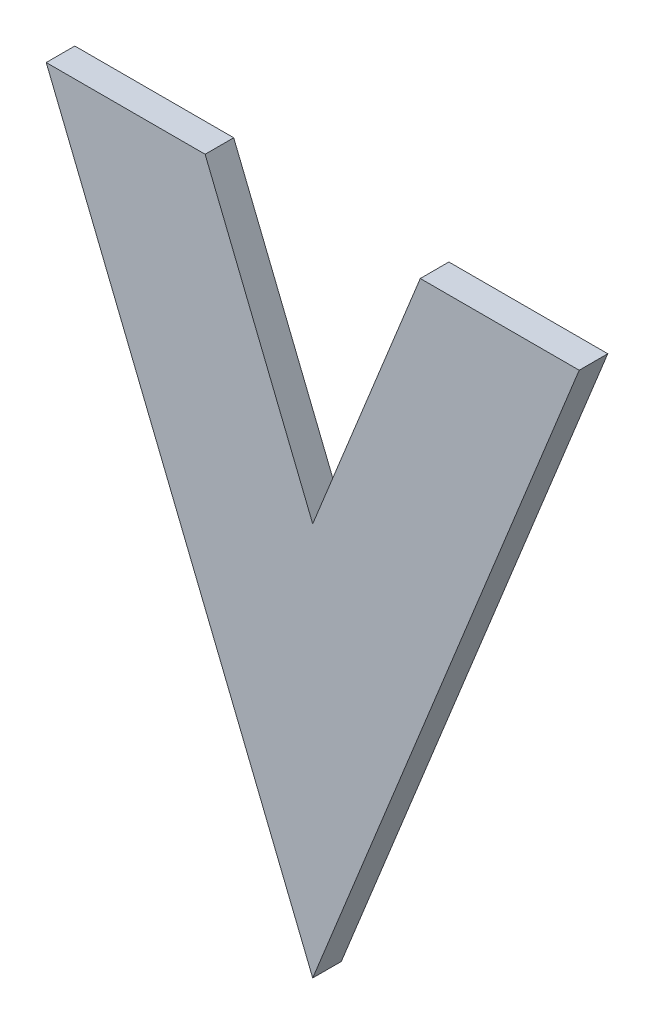
ISO-10303-21;
HEADER;
FILE_DESCRIPTION(('STEP AP214'),'2;1');
FILE_NAME('part.step','',(''),(''),'','','');
FILE_SCHEMA(('AUTOMOTIVE_DESIGN { 1 0 10303 214 1 1 1 1 }'));
ENDSEC;
DATA;
#1=APPLICATION_CONTEXT('core data for automotive mechanical design processes');
#2=APPLICATION_PROTOCOL_DEFINITION('international standard','automotive_design',2000,#1);
#3=PRODUCT_CONTEXT('',#1,'mechanical');
#4=PRODUCT('Part','Part','',(#3));
#5=PRODUCT_RELATED_PRODUCT_CATEGORY('part','',(#4));
#6=PRODUCT_DEFINITION_FORMATION('','',#4);
#7=PRODUCT_DEFINITION_CONTEXT('part definition',#1,'design');
#8=PRODUCT_DEFINITION('design','',#6,#7);
#9=PRODUCT_DEFINITION_SHAPE('','',#8);
#10=(LENGTH_UNIT() NAMED_UNIT(*) SI_UNIT(.MILLI.,.METRE.));
#11=(NAMED_UNIT(*) PLANE_ANGLE_UNIT() SI_UNIT($,.RADIAN.));
#12=(NAMED_UNIT(*) SI_UNIT($,.STERADIAN.) SOLID_ANGLE_UNIT());
#13=UNCERTAINTY_MEASURE_WITH_UNIT(LENGTH_MEASURE(1.E-05),#10,'distance_accuracy_value','');
#14=(GEOMETRIC_REPRESENTATION_CONTEXT(3) GLOBAL_UNCERTAINTY_ASSIGNED_CONTEXT((#13)) GLOBAL_UNIT_ASSIGNED_CONTEXT((#10,
#11,#12)) REPRESENTATION_CONTEXT('',''));
#15=CARTESIAN_POINT('',(0.,0.,0.));
#16=DIRECTION('',(0.,0.,1.));
#17=DIRECTION('',(1.,0.,0.));
#18=AXIS2_PLACEMENT_3D('',#15,#16,#17);
#19=CARTESIAN_POINT('',(0.0956398811616661,-0.536906195260859,0.));
#20=DIRECTION('',(0.927183854566715,-0.37460659341609,0.));
#21=DIRECTION('',(0.37460659341609,0.927183854566715,0.));
#22=AXIS2_PLACEMENT_3D('',#19,#20,#21);
#23=PLANE('',#22);
#24=DIRECTION('',(0.37460659341609,0.927183854566715,0.));
#25=VECTOR('',#24,1.);
#26=CARTESIAN_POINT('',(0.0956398811616661,-0.536906195260859,0.));
#27=LINE('',#26,#25);
#28=CARTESIAN_POINT('',(0.0956398811616661,-0.536906195260859,0.));
#29=VERTEX_POINT('',#28);
#30=CARTESIAN_POINT('',(0.123607816936886,-0.467683125106459,0.));
#31=VERTEX_POINT('',#30);
#32=EDGE_CURVE('E11',#29,#31,#27,.T.);
#33=ORIENTED_EDGE('',*,*,#32,.T.);
#34=DIRECTION('',(0.,0.,1.));
#35=VECTOR('',#34,1.);
#36=CARTESIAN_POINT('',(0.123607816936886,-0.467683125106459,0.));
#37=LINE('',#36,#35);
#38=CARTESIAN_POINT('',(0.123607816936886,-0.467683125106459,0.003));
#39=VERTEX_POINT('',#38);
#40=EDGE_CURVE('E24',#31,#39,#37,.T.);
#41=ORIENTED_EDGE('',*,*,#40,.T.);
#42=DIRECTION('',(0.37460659341609,0.927183854566715,0.));
#43=VECTOR('',#42,1.);
#44=CARTESIAN_POINT('',(0.0956398811616661,-0.536906195260859,0.003));
#45=LINE('',#44,#43);
#46=CARTESIAN_POINT('',(0.0956398811616661,-0.536906195260859,0.003));
#47=VERTEX_POINT('',#46);
#48=EDGE_CURVE('E88',#47,#39,#45,.T.);
#49=ORIENTED_EDGE('',*,*,#48,.F.);
#50=DIRECTION('',(0.,0.,1.));
#51=VECTOR('',#50,1.);
#52=CARTESIAN_POINT('',(0.0956398811616661,-0.536906195260859,0.));
#53=LINE('',#52,#51);
#54=EDGE_CURVE('E116',#29,#47,#53,.T.);
#55=ORIENTED_EDGE('',*,*,#54,.F.);
#56=EDGE_LOOP('',(#33,#41,#49,#55));
#57=FACE_BOUND('',#56,.T.);
#58=ADVANCED_FACE('F17',(#57),#23,.T.);
#59=CARTESIAN_POINT('',(0.0676719453864461,-0.467683125106459,0.));
#60=DIRECTION('',(-0.927183854566715,-0.374606593416091,0.));
#61=DIRECTION('',(0.374606593416091,-0.927183854566715,0.));
#62=AXIS2_PLACEMENT_3D('',#59,#60,#61);
#63=PLANE('',#62);
#64=DIRECTION('',(0.374606593416091,-0.927183854566715,0.));
#65=VECTOR('',#64,1.);
#66=CARTESIAN_POINT('',(0.0676719453864461,-0.467683125106459,0.));
#67=LINE('',#66,#65);
#68=CARTESIAN_POINT('',(0.0676719453864461,-0.467683125106459,0.));
#69=VERTEX_POINT('',#68);
#70=EDGE_CURVE('E113',#69,#29,#67,.T.);
#71=ORIENTED_EDGE('',*,*,#70,.T.);
#72=ORIENTED_EDGE('',*,*,#54,.T.);
#73=DIRECTION('',(0.374606593416091,-0.927183854566715,0.));
#74=VECTOR('',#73,1.);
#75=CARTESIAN_POINT('',(0.0676719453864461,-0.467683125106459,0.003));
#76=LINE('',#75,#74);
#77=CARTESIAN_POINT('',(0.0676719453864461,-0.467683125106459,0.003));
#78=VERTEX_POINT('',#77);
#79=EDGE_CURVE('E111',#78,#47,#76,.T.);
#80=ORIENTED_EDGE('',*,*,#79,.F.);
#81=DIRECTION('',(0.,0.,1.));
#82=VECTOR('',#81,1.);
#83=CARTESIAN_POINT('',(0.0676719453864461,-0.467683125106459,0.));
#84=LINE('',#83,#82);
#85=EDGE_CURVE('E108',#69,#78,#84,.T.);
#86=ORIENTED_EDGE('',*,*,#85,.F.);
#87=EDGE_LOOP('',(#71,#72,#80,#86));
#88=FACE_BOUND('',#87,.T.);
#89=ADVANCED_FACE('F127',(#88),#63,.T.);
#90=CARTESIAN_POINT('',(0.0843489453864461,-0.467683125106459,0.));
#91=DIRECTION('',(0.,1.,0.));
#92=DIRECTION('',(-1.,0.,0.));
#93=AXIS2_PLACEMENT_3D('',#90,#91,#92);
#94=PLANE('',#93);
#95=DIRECTION('',(-1.,0.,0.));
#96=VECTOR('',#95,1.);
#97=CARTESIAN_POINT('',(0.0843489453864461,-0.467683125106459,0.));
#98=LINE('',#97,#96);
#99=CARTESIAN_POINT('',(0.0843489453864461,-0.467683125106459,0.));
#100=VERTEX_POINT('',#99);
#101=EDGE_CURVE('E105',#100,#69,#98,.T.);
#102=ORIENTED_EDGE('',*,*,#101,.T.);
#103=ORIENTED_EDGE('',*,*,#85,.T.);
#104=DIRECTION('',(-1.,0.,0.));
#105=VECTOR('',#104,1.);
#106=CARTESIAN_POINT('',(0.0843489453864461,-0.467683125106459,0.003));
#107=LINE('',#106,#105);
#108=CARTESIAN_POINT('',(0.0843489453864461,-0.467683125106459,0.003));
#109=VERTEX_POINT('',#108);
#110=EDGE_CURVE('E102',#109,#78,#107,.T.);
#111=ORIENTED_EDGE('',*,*,#110,.F.);
#112=DIRECTION('',(0.,0.,1.));
#113=VECTOR('',#112,1.);
#114=CARTESIAN_POINT('',(0.0843489453864461,-0.467683125106459,0.));
#115=LINE('',#114,#113);
#116=EDGE_CURVE('E99',#100,#109,#115,.T.);
#117=ORIENTED_EDGE('',*,*,#116,.F.);
#118=EDGE_LOOP('',(#102,#103,#111,#117));
#119=FACE_BOUND('',#118,.T.);
#120=ADVANCED_FACE('F124',(#119),#94,.T.);
#121=CARTESIAN_POINT('',(0.0956398811616661,-0.495629171806459,0.));
#122=DIRECTION('',(0.927183854566718,0.374606593416083,0.));
#123=DIRECTION('',(-0.374606593416083,0.927183854566718,0.));
#124=AXIS2_PLACEMENT_3D('',#121,#122,#123);
#125=PLANE('',#124);
#126=DIRECTION('',(-0.374606593416083,0.927183854566718,0.));
#127=VECTOR('',#126,1.);
#128=CARTESIAN_POINT('',(0.0956398811616661,-0.495629171806459,0.));
#129=LINE('',#128,#127);
#130=CARTESIAN_POINT('',(0.0956398811616661,-0.495629171806459,0.));
#131=VERTEX_POINT('',#130);
#132=EDGE_CURVE('E96',#131,#100,#129,.T.);
#133=ORIENTED_EDGE('',*,*,#132,.T.);
#134=ORIENTED_EDGE('',*,*,#116,.T.);
#135=DIRECTION('',(-0.374606593416083,0.927183854566718,0.));
#136=VECTOR('',#135,1.);
#137=CARTESIAN_POINT('',(0.0956398811616661,-0.495629171806459,0.003));
#138=LINE('',#137,#136);
#139=CARTESIAN_POINT('',(0.0956398811616661,-0.495629171806459,0.003));
#140=VERTEX_POINT('',#139);
#141=EDGE_CURVE('E94',#140,#109,#138,.T.);
#142=ORIENTED_EDGE('',*,*,#141,.F.);
#143=DIRECTION('',(0.,0.,1.));
#144=VECTOR('',#143,1.);
#145=CARTESIAN_POINT('',(0.0956398811616661,-0.495629171806459,0.));
#146=LINE('',#145,#144);
#147=EDGE_CURVE('E73',#131,#140,#146,.T.);
#148=ORIENTED_EDGE('',*,*,#147,.F.);
#149=EDGE_LOOP('',(#133,#134,#142,#148));
#150=FACE_BOUND('',#149,.T.);
#151=ADVANCED_FACE('F122',(#150),#125,.T.);
#152=CARTESIAN_POINT('',(0.106930816936869,-0.467683125106459,0.));
#153=DIRECTION('',(-0.927183854566916,0.374606593415595,0.));
#154=DIRECTION('',(-0.374606593415595,-0.927183854566916,0.));
#155=AXIS2_PLACEMENT_3D('',#152,#153,#154);
#156=PLANE('',#155);
#157=DIRECTION('',(-0.374606593415595,-0.927183854566916,0.));
#158=VECTOR('',#157,1.);
#159=CARTESIAN_POINT('',(0.106930816936869,-0.467683125106459,0.));
#160=LINE('',#159,#158);
#161=CARTESIAN_POINT('',(0.106930816936869,-0.467683125106459,0.));
#162=VERTEX_POINT('',#161);
#163=EDGE_CURVE('E77',#162,#131,#160,.T.);
#164=ORIENTED_EDGE('',*,*,#163,.T.);
#165=ORIENTED_EDGE('',*,*,#147,.T.);
#166=DIRECTION('',(-0.374606593415595,-0.927183854566916,0.));
#167=VECTOR('',#166,1.);
#168=CARTESIAN_POINT('',(0.106930816936869,-0.467683125106459,0.003));
#169=LINE('',#168,#167);
#170=CARTESIAN_POINT('',(0.106930816936869,-0.467683125106459,0.003));
#171=VERTEX_POINT('',#170);
#172=EDGE_CURVE('E66',#171,#140,#169,.T.);
#173=ORIENTED_EDGE('',*,*,#172,.F.);
#174=DIRECTION('',(0.,0.,1.));
#175=VECTOR('',#174,1.);
#176=CARTESIAN_POINT('',(0.106930816936869,-0.467683125106459,0.));
#177=LINE('',#176,#175);
#178=EDGE_CURVE('E70',#162,#171,#177,.T.);
#179=ORIENTED_EDGE('',*,*,#178,.F.);
#180=EDGE_LOOP('',(#164,#165,#173,#179));
#181=FACE_BOUND('',#180,.T.);
#182=ADVANCED_FACE('F69',(#181),#156,.T.);
#183=CARTESIAN_POINT('',(0.123607816936886,-0.467683125106459,0.));
#184=DIRECTION('',(0.,1.,0.));
#185=DIRECTION('',(-1.,0.,0.));
#186=AXIS2_PLACEMENT_3D('',#183,#184,#185);
#187=PLANE('',#186);
#188=DIRECTION('',(-1.,0.,0.));
#189=VECTOR('',#188,1.);
#190=CARTESIAN_POINT('',(0.123607816936886,-0.467683125106459,0.));
#191=LINE('',#190,#189);
#192=EDGE_CURVE('E83',#31,#162,#191,.T.);
#193=ORIENTED_EDGE('',*,*,#192,.T.);
#194=ORIENTED_EDGE('',*,*,#178,.T.);
#195=DIRECTION('',(-1.,0.,0.));
#196=VECTOR('',#195,1.);
#197=CARTESIAN_POINT('',(0.123607816936886,-0.467683125106459,0.003));
#198=LINE('',#197,#196);
#199=EDGE_CURVE('E82',#39,#171,#198,.T.);
#200=ORIENTED_EDGE('',*,*,#199,.F.);
#201=ORIENTED_EDGE('',*,*,#40,.F.);
#202=EDGE_LOOP('',(#193,#194,#200,#201));
#203=FACE_BOUND('',#202,.T.);
#204=ADVANCED_FACE('F81',(#203),#187,.T.);
#205=CARTESIAN_POINT('',(0.0956398811616661,-0.502294660183659,0.003));
#206=DIRECTION('',(0.,0.,1.));
#207=DIRECTION('',(1.,0.,0.));
#208=AXIS2_PLACEMENT_3D('',#205,#206,#207);
#209=PLANE('',#208);
#210=ORIENTED_EDGE('',*,*,#199,.T.);
#211=ORIENTED_EDGE('',*,*,#172,.T.);
#212=ORIENTED_EDGE('',*,*,#141,.T.);
#213=ORIENTED_EDGE('',*,*,#110,.T.);
#214=ORIENTED_EDGE('',*,*,#79,.T.);
#215=ORIENTED_EDGE('',*,*,#48,.T.);
#216=EDGE_LOOP('',(#210,#211,#212,#213,#214,#215));
#217=FACE_BOUND('',#216,.T.);
#218=ADVANCED_FACE('F86',(#217),#209,.T.);
#219=CARTESIAN_POINT('',(0.0956398811616661,-0.502294660183659,0.));
#220=DIRECTION('',(0.,0.,1.));
#221=DIRECTION('',(1.,0.,0.));
#222=AXIS2_PLACEMENT_3D('',#219,#220,#221);
#223=PLANE('',#222);
#224=ORIENTED_EDGE('',*,*,#192,.F.);
#225=ORIENTED_EDGE('',*,*,#32,.F.);
#226=ORIENTED_EDGE('',*,*,#70,.F.);
#227=ORIENTED_EDGE('',*,*,#101,.F.);
#228=ORIENTED_EDGE('',*,*,#132,.F.);
#229=ORIENTED_EDGE('',*,*,#163,.F.);
#230=EDGE_LOOP('',(#224,#225,#226,#227,#228,#229));
#231=FACE_BOUND('',#230,.T.);
#232=ADVANCED_FACE('F119',(#231),#223,.F.);
#233=CLOSED_SHELL('',(#58,#89,#120,#151,#182,#204,#218,#232));
#234=MANIFOLD_SOLID_BREP('B1',#233);
#235=ADVANCED_BREP_SHAPE_REPRESENTATION('',(#18,#234),#14);
#236=SHAPE_DEFINITION_REPRESENTATION(#9,#235);
ENDSEC;
END-ISO-10303-21;
